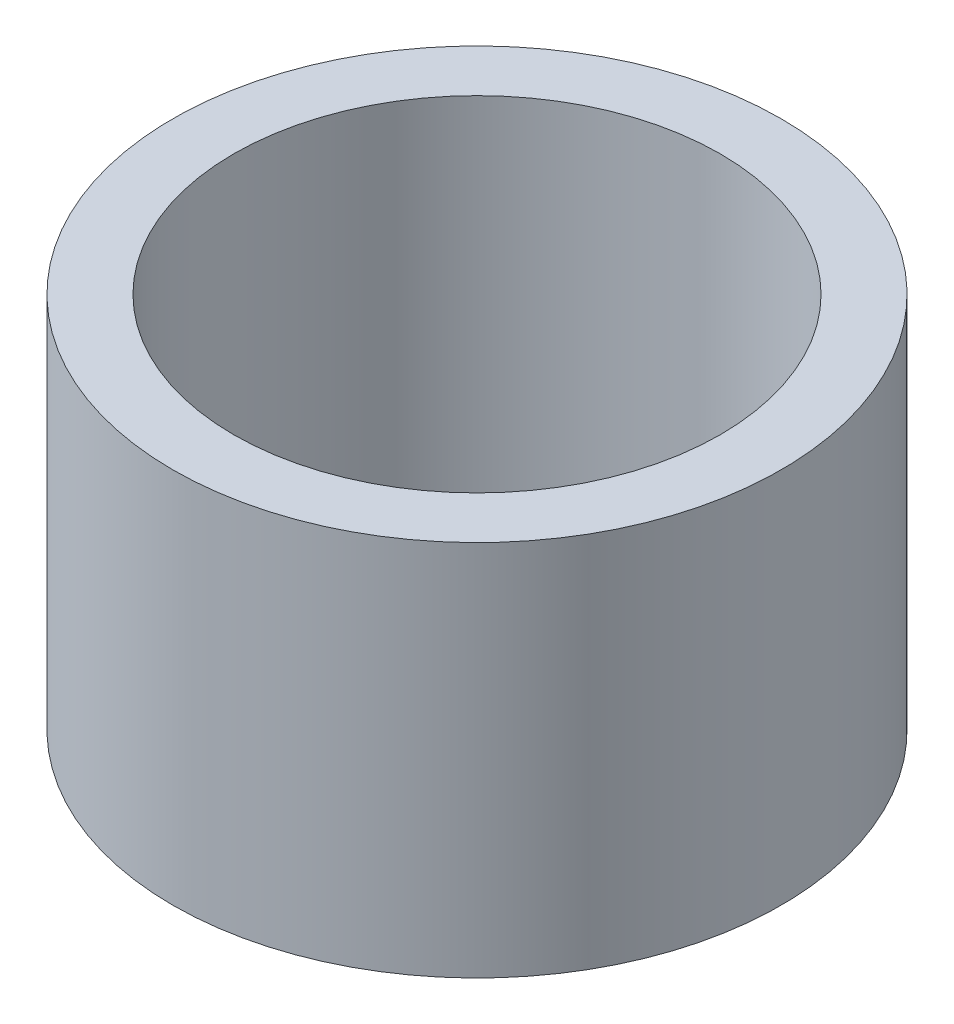
ISO-10303-21;
HEADER;
FILE_DESCRIPTION(('STEP AP214'),'2;1');
FILE_NAME('part.step','',(''),(''),'','','');
FILE_SCHEMA(('AUTOMOTIVE_DESIGN { 1 0 10303 214 1 1 1 1 }'));
ENDSEC;
DATA;
#1=APPLICATION_CONTEXT('core data for automotive mechanical design processes');
#2=APPLICATION_PROTOCOL_DEFINITION('international standard','automotive_design',2000,#1);
#3=PRODUCT_CONTEXT('',#1,'mechanical');
#4=PRODUCT('Part','Part','',(#3));
#5=PRODUCT_RELATED_PRODUCT_CATEGORY('part','',(#4));
#6=PRODUCT_DEFINITION_FORMATION('','',#4);
#7=PRODUCT_DEFINITION_CONTEXT('part definition',#1,'design');
#8=PRODUCT_DEFINITION('design','',#6,#7);
#9=PRODUCT_DEFINITION_SHAPE('','',#8);
#10=(LENGTH_UNIT() NAMED_UNIT(*) SI_UNIT(.MILLI.,.METRE.));
#11=(NAMED_UNIT(*) PLANE_ANGLE_UNIT() SI_UNIT($,.RADIAN.));
#12=(NAMED_UNIT(*) SI_UNIT($,.STERADIAN.) SOLID_ANGLE_UNIT());
#13=UNCERTAINTY_MEASURE_WITH_UNIT(LENGTH_MEASURE(1.E-05),#10,'distance_accuracy_value','');
#14=(GEOMETRIC_REPRESENTATION_CONTEXT(3) GLOBAL_UNCERTAINTY_ASSIGNED_CONTEXT((#13)) GLOBAL_UNIT_ASSIGNED_CONTEXT((#10,
#11,#12)) REPRESENTATION_CONTEXT('',''));
#15=CARTESIAN_POINT('',(0.,0.,0.));
#16=DIRECTION('',(0.,0.,1.));
#17=DIRECTION('',(1.,0.,0.));
#18=AXIS2_PLACEMENT_3D('',#15,#16,#17);
#19=CARTESIAN_POINT('',(0.,9.8425,0.));
#20=DIRECTION('',(0.,1.,0.));
#21=DIRECTION('',(0.,0.,1.));
#22=AXIS2_PLACEMENT_3D('',#19,#20,#21);
#23=PLANE('',#22);
#24=CARTESIAN_POINT('',(0.,9.8425,0.));
#25=DIRECTION('',(0.,1.,0.));
#26=DIRECTION('',(0.,0.,1.));
#27=AXIS2_PLACEMENT_3D('',#24,#25,#26);
#28=CIRCLE('',#27,7.9375);
#29=CARTESIAN_POINT('',(0.,9.8425,7.9375));
#30=VERTEX_POINT('',#29);
#31=EDGE_CURVE('E10',#30,#30,#28,.T.);
#32=ORIENTED_EDGE('',*,*,#31,.T.);
#33=EDGE_LOOP('',(#32));
#34=FACE_BOUND('',#33,.T.);
#35=CARTESIAN_POINT('',(0.,9.8425,0.));
#36=DIRECTION('',(0.,1.,0.));
#37=DIRECTION('',(0.,0.,1.));
#38=AXIS2_PLACEMENT_3D('',#35,#36,#37);
#39=CIRCLE('',#38,6.35);
#40=CARTESIAN_POINT('',(0.,9.8425,6.35));
#41=VERTEX_POINT('',#40);
#42=EDGE_CURVE('E54',#41,#41,#39,.T.);
#43=ORIENTED_EDGE('',*,*,#42,.F.);
#44=EDGE_LOOP('',(#43));
#45=FACE_BOUND('',#44,.T.);
#46=ADVANCED_FACE('F41',(#34,#45),#23,.T.);
#47=CARTESIAN_POINT('',(0.,0.,0.));
#48=DIRECTION('',(0.,1.,0.));
#49=DIRECTION('',(0.,0.,1.));
#50=AXIS2_PLACEMENT_3D('',#47,#48,#49);
#51=PLANE('',#50);
#52=CARTESIAN_POINT('',(0.,0.,0.));
#53=DIRECTION('',(0.,1.,0.));
#54=DIRECTION('',(0.,0.,1.));
#55=AXIS2_PLACEMENT_3D('',#52,#53,#54);
#56=CIRCLE('',#55,7.9375);
#57=CARTESIAN_POINT('',(0.,0.,7.9375));
#58=VERTEX_POINT('',#57);
#59=EDGE_CURVE('E45',#58,#58,#56,.T.);
#60=ORIENTED_EDGE('',*,*,#59,.F.);
#61=EDGE_LOOP('',(#60));
#62=FACE_BOUND('',#61,.T.);
#63=CARTESIAN_POINT('',(0.,0.,0.));
#64=DIRECTION('',(0.,1.,0.));
#65=DIRECTION('',(0.,0.,1.));
#66=AXIS2_PLACEMENT_3D('',#63,#64,#65);
#67=CIRCLE('',#66,6.35);
#68=CARTESIAN_POINT('',(0.,0.,6.35));
#69=VERTEX_POINT('',#68);
#70=EDGE_CURVE('E56',#69,#69,#67,.T.);
#71=ORIENTED_EDGE('',*,*,#70,.T.);
#72=EDGE_LOOP('',(#71));
#73=FACE_BOUND('',#72,.T.);
#74=ADVANCED_FACE('F68',(#62,#73),#51,.F.);
#75=CARTESIAN_POINT('',(0.,9.8425,0.));
#76=DIRECTION('',(0.,-1.,0.));
#77=DIRECTION('',(0.,0.,-1.));
#78=AXIS2_PLACEMENT_3D('',#75,#76,#77);
#79=CYLINDRICAL_SURFACE('',#78,7.9375);
#80=ORIENTED_EDGE('',*,*,#31,.F.);
#81=EDGE_LOOP('',(#80));
#82=FACE_BOUND('',#81,.T.);
#83=ORIENTED_EDGE('',*,*,#59,.T.);
#84=EDGE_LOOP('',(#83));
#85=FACE_BOUND('',#84,.T.);
#86=ADVANCED_FACE('F43',(#82,#85),#79,.T.);
#87=CARTESIAN_POINT('',(0.,9.8425,0.));
#88=DIRECTION('',(0.,-1.,0.));
#89=DIRECTION('',(0.,0.,-1.));
#90=AXIS2_PLACEMENT_3D('',#87,#88,#89);
#91=CYLINDRICAL_SURFACE('',#90,6.35);
#92=ORIENTED_EDGE('',*,*,#42,.T.);
#93=EDGE_LOOP('',(#92));
#94=FACE_BOUND('',#93,.T.);
#95=ORIENTED_EDGE('',*,*,#70,.F.);
#96=EDGE_LOOP('',(#95));
#97=FACE_BOUND('',#96,.T.);
#98=ADVANCED_FACE('F64',(#94,#97),#91,.F.);
#99=CLOSED_SHELL('',(#46,#74,#86,#98));
#100=MANIFOLD_SOLID_BREP('B2',#99);
#101=ADVANCED_BREP_SHAPE_REPRESENTATION('',(#18,#100),#14);
#102=SHAPE_DEFINITION_REPRESENTATION(#9,#101);
ENDSEC;
END-ISO-10303-21;
